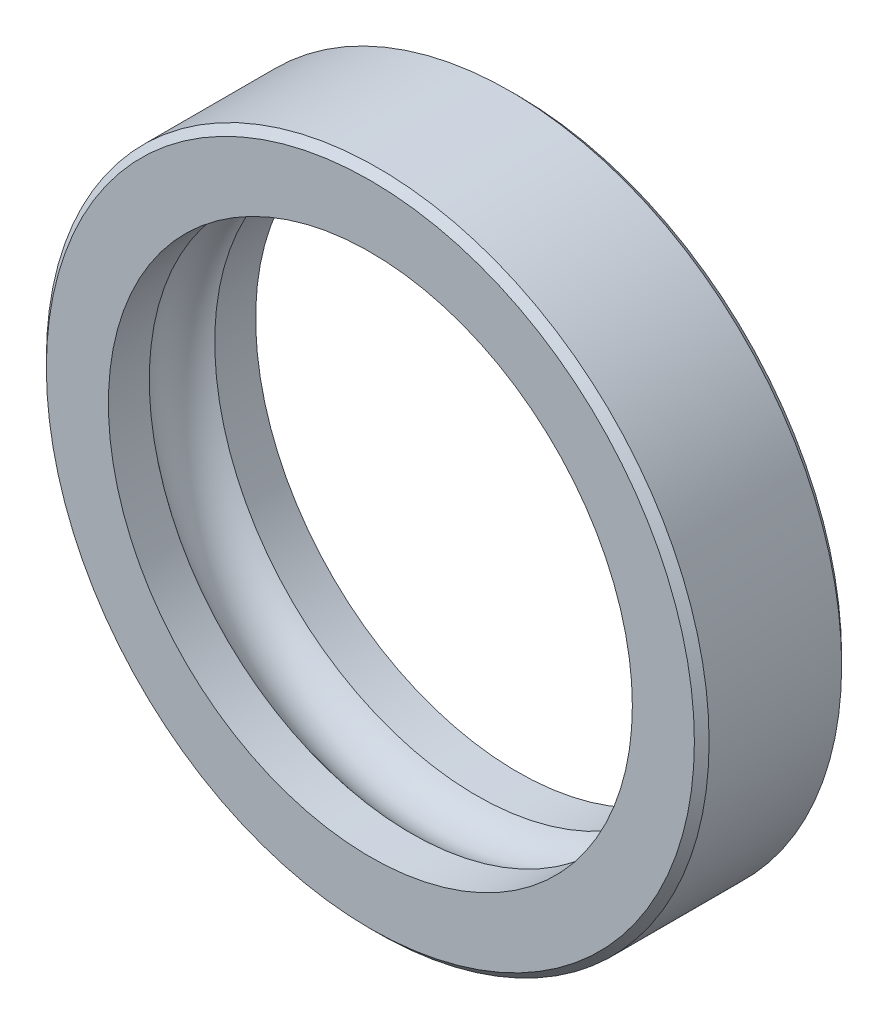
ISO-10303-21;
HEADER;
FILE_DESCRIPTION(('STEP AP214'),'2;1');
FILE_NAME('part.step','',(''),(''),'','','');
FILE_SCHEMA(('AUTOMOTIVE_DESIGN { 1 0 10303 214 1 1 1 1 }'));
ENDSEC;
DATA;
#1=APPLICATION_CONTEXT('core data for automotive mechanical design processes');
#2=APPLICATION_PROTOCOL_DEFINITION('international standard','automotive_design',2000,#1);
#3=PRODUCT_CONTEXT('',#1,'mechanical');
#4=PRODUCT('Part','Part','',(#3));
#5=PRODUCT_RELATED_PRODUCT_CATEGORY('part','',(#4));
#6=PRODUCT_DEFINITION_FORMATION('','',#4);
#7=PRODUCT_DEFINITION_CONTEXT('part definition',#1,'design');
#8=PRODUCT_DEFINITION('design','',#6,#7);
#9=PRODUCT_DEFINITION_SHAPE('','',#8);
#10=(LENGTH_UNIT() NAMED_UNIT(*) SI_UNIT(.MILLI.,.METRE.));
#11=(NAMED_UNIT(*) PLANE_ANGLE_UNIT() SI_UNIT($,.RADIAN.));
#12=(NAMED_UNIT(*) SI_UNIT($,.STERADIAN.) SOLID_ANGLE_UNIT());
#13=UNCERTAINTY_MEASURE_WITH_UNIT(LENGTH_MEASURE(1.E-05),#10,'distance_accuracy_value','');
#14=(GEOMETRIC_REPRESENTATION_CONTEXT(3) GLOBAL_UNCERTAINTY_ASSIGNED_CONTEXT((#13)) GLOBAL_UNIT_ASSIGNED_CONTEXT((#10,
#11,#12)) REPRESENTATION_CONTEXT('',''));
#15=CARTESIAN_POINT('',(0.,0.,0.));
#16=DIRECTION('',(0.,0.,1.));
#17=DIRECTION('',(1.,0.,0.));
#18=AXIS2_PLACEMENT_3D('',#15,#16,#17);
#19=CARTESIAN_POINT('',(0.,0.,0.));
#20=DIRECTION('',(0.,0.,1.));
#21=DIRECTION('',(1.,0.,0.));
#22=AXIS2_PLACEMENT_3D('',#19,#20,#21);
#23=TOROIDAL_SURFACE('',#22,10.31875,1.71627890103155);
#24=CARTESIAN_POINT('',(0.,0.,-1.41111111111112));
#25=DIRECTION('',(0.,0.,1.));
#26=DIRECTION('',(1.,0.,0.));
#27=AXIS2_PLACEMENT_3D('',#24,#25,#26);
#28=CIRCLE('',#27,11.2956730769231);
#29=CARTESIAN_POINT('',(11.2956730769231,0.,-1.41111111111112));
#30=VERTEX_POINT('',#29);
#31=EDGE_CURVE('E38',#30,#30,#28,.F.);
#32=ORIENTED_EDGE('',*,*,#31,.T.);
#33=EDGE_LOOP('',(#32));
#34=FACE_BOUND('',#33,.T.);
#35=CARTESIAN_POINT('',(0.,0.,1.4111111111111));
#36=DIRECTION('',(0.,0.,1.));
#37=DIRECTION('',(1.,0.,0.));
#38=AXIS2_PLACEMENT_3D('',#35,#36,#37);
#39=CIRCLE('',#38,11.2956730769231);
#40=CARTESIAN_POINT('',(11.2956730769231,0.,1.4111111111111));
#41=VERTEX_POINT('',#40);
#42=EDGE_CURVE('E35',#41,#41,#39,.T.);
#43=ORIENTED_EDGE('',*,*,#42,.T.);
#44=EDGE_LOOP('',(#43));
#45=FACE_BOUND('',#44,.T.);
#46=ADVANCED_FACE('F15',(#34,#45),#23,.F.);
#47=CARTESIAN_POINT('',(0.,0.,3.175));
#48=DIRECTION('',(0.,0.,1.));
#49=DIRECTION('',(1.,0.,0.));
#50=AXIS2_PLACEMENT_3D('',#47,#48,#49);
#51=CYLINDRICAL_SURFACE('',#50,11.2956730769231);
#52=CARTESIAN_POINT('',(0.,0.,-3.175));
#53=DIRECTION('',(0.,0.,1.));
#54=DIRECTION('',(1.,0.,0.));
#55=AXIS2_PLACEMENT_3D('',#52,#53,#54);
#56=CIRCLE('',#55,11.2956730769231);
#57=CARTESIAN_POINT('',(11.2956730769231,0.,-3.175));
#58=VERTEX_POINT('',#57);
#59=EDGE_CURVE('E19',#58,#58,#56,.F.);
#60=ORIENTED_EDGE('',*,*,#59,.T.);
#61=EDGE_LOOP('',(#60));
#62=FACE_BOUND('',#61,.T.);
#63=ORIENTED_EDGE('',*,*,#31,.F.);
#64=EDGE_LOOP('',(#63));
#65=FACE_BOUND('',#64,.T.);
#66=ADVANCED_FACE('F57',(#62,#65),#51,.F.);
#67=CARTESIAN_POINT('',(0.,0.,3.175));
#68=DIRECTION('',(0.,0.,1.));
#69=DIRECTION('',(1.,0.,0.));
#70=AXIS2_PLACEMENT_3D('',#67,#68,#69);
#71=CYLINDRICAL_SURFACE('',#70,11.2956730769231);
#72=ORIENTED_EDGE('',*,*,#42,.F.);
#73=EDGE_LOOP('',(#72));
#74=FACE_BOUND('',#73,.T.);
#75=CARTESIAN_POINT('',(0.,0.,3.175));
#76=DIRECTION('',(0.,0.,1.));
#77=DIRECTION('',(1.,0.,0.));
#78=AXIS2_PLACEMENT_3D('',#75,#76,#77);
#79=CIRCLE('',#78,11.2956730769231);
#80=CARTESIAN_POINT('',(11.2956730769231,0.,3.175));
#81=VERTEX_POINT('',#80);
#82=EDGE_CURVE('E50',#81,#81,#79,.T.);
#83=ORIENTED_EDGE('',*,*,#82,.T.);
#84=EDGE_LOOP('',(#83));
#85=FACE_BOUND('',#84,.T.);
#86=ADVANCED_FACE('F64',(#74,#85),#71,.F.);
#87=CARTESIAN_POINT('',(0.,13.97,-3.175));
#88=DIRECTION('',(0.,0.,1.));
#89=DIRECTION('',(1.,0.,0.));
#90=AXIS2_PLACEMENT_3D('',#87,#88,#89);
#91=PLANE('',#90);
#92=ORIENTED_EDGE('',*,*,#59,.F.);
#93=EDGE_LOOP('',(#92));
#94=FACE_BOUND('',#93,.T.);
#95=CARTESIAN_POINT('',(0.,0.,-3.17500001025784));
#96=DIRECTION('',(0.,0.,1.));
#97=DIRECTION('',(1.,0.,0.));
#98=AXIS2_PLACEMENT_3D('',#95,#96,#97);
#99=CIRCLE('',#98,13.9700000102578);
#100=CARTESIAN_POINT('',(13.9700000102578,0.,-3.17500001025784));
#101=VERTEX_POINT('',#100);
#102=EDGE_CURVE('E48',#101,#101,#99,.T.);
#103=ORIENTED_EDGE('',*,*,#102,.F.);
#104=EDGE_LOOP('',(#103));
#105=FACE_BOUND('',#104,.T.);
#106=ADVANCED_FACE('F60',(#94,#105),#91,.F.);
#107=CARTESIAN_POINT('',(0.,13.97,3.175));
#108=DIRECTION('',(0.,0.,-1.));
#109=DIRECTION('',(-1.,0.,0.));
#110=AXIS2_PLACEMENT_3D('',#107,#108,#109);
#111=PLANE('',#110);
#112=ORIENTED_EDGE('',*,*,#82,.F.);
#113=EDGE_LOOP('',(#112));
#114=FACE_BOUND('',#113,.T.);
#115=CARTESIAN_POINT('',(0.,0.,3.17500001025783));
#116=DIRECTION('',(0.,0.,-1.));
#117=DIRECTION('',(-1.,0.,0.));
#118=AXIS2_PLACEMENT_3D('',#115,#116,#117);
#119=CIRCLE('',#118,13.9700000102578);
#120=CARTESIAN_POINT('',(-13.9700000102578,0.,3.17500001025783));
#121=VERTEX_POINT('',#120);
#122=EDGE_CURVE('E28',#121,#121,#119,.T.);
#123=ORIENTED_EDGE('',*,*,#122,.F.);
#124=EDGE_LOOP('',(#123));
#125=FACE_BOUND('',#124,.T.);
#126=ADVANCED_FACE('F63',(#114,#125),#111,.F.);
#127=CARTESIAN_POINT('',(0.,0.,-2.8575000099729));
#128=DIRECTION('',(0.,0.,1.));
#129=DIRECTION('',(1.,0.,0.));
#130=AXIS2_PLACEMENT_3D('',#127,#128,#129);
#131=CONICAL_SURFACE('',#130,14.2875000099729,0.785398162499998);
#132=CARTESIAN_POINT('',(0.,0.,-2.8575));
#133=DIRECTION('',(0.,0.,1.));
#134=DIRECTION('',(1.,0.,0.));
#135=AXIS2_PLACEMENT_3D('',#132,#133,#134);
#136=CIRCLE('',#135,14.2875);
#137=CARTESIAN_POINT('',(14.2875,0.,-2.8575));
#138=VERTEX_POINT('',#137);
#139=EDGE_CURVE('E23',#138,#138,#136,.T.);
#140=ORIENTED_EDGE('',*,*,#139,.F.);
#141=EDGE_LOOP('',(#140));
#142=FACE_BOUND('',#141,.T.);
#143=ORIENTED_EDGE('',*,*,#102,.T.);
#144=EDGE_LOOP('',(#143));
#145=FACE_BOUND('',#144,.T.);
#146=ADVANCED_FACE('F68',(#142,#145),#131,.T.);
#147=CARTESIAN_POINT('',(0.,0.,2.85750000997289));
#148=DIRECTION('',(0.,0.,-1.));
#149=DIRECTION('',(-1.,0.,0.));
#150=AXIS2_PLACEMENT_3D('',#147,#148,#149);
#151=CONICAL_SURFACE('',#150,14.2875000099729,0.785398162499998);
#152=CARTESIAN_POINT('',(0.,0.,2.8575));
#153=DIRECTION('',(0.,0.,1.));
#154=DIRECTION('',(1.,0.,0.));
#155=AXIS2_PLACEMENT_3D('',#152,#153,#154);
#156=CIRCLE('',#155,14.2875);
#157=CARTESIAN_POINT('',(14.2875,0.,2.8575));
#158=VERTEX_POINT('',#157);
#159=EDGE_CURVE('E10',#158,#158,#156,.F.);
#160=ORIENTED_EDGE('',*,*,#159,.F.);
#161=EDGE_LOOP('',(#160));
#162=FACE_BOUND('',#161,.T.);
#163=ORIENTED_EDGE('',*,*,#122,.T.);
#164=EDGE_LOOP('',(#163));
#165=FACE_BOUND('',#164,.T.);
#166=ADVANCED_FACE('F70',(#162,#165),#151,.T.);
#167=CARTESIAN_POINT('',(0.,0.,3.175));
#168=DIRECTION('',(0.,0.,1.));
#169=DIRECTION('',(1.,0.,0.));
#170=AXIS2_PLACEMENT_3D('',#167,#168,#169);
#171=CYLINDRICAL_SURFACE('',#170,14.2875);
#172=ORIENTED_EDGE('',*,*,#159,.T.);
#173=EDGE_LOOP('',(#172));
#174=FACE_BOUND('',#173,.T.);
#175=ORIENTED_EDGE('',*,*,#139,.T.);
#176=EDGE_LOOP('',(#175));
#177=FACE_BOUND('',#176,.T.);
#178=ADVANCED_FACE('F78',(#174,#177),#171,.T.);
#179=CLOSED_SHELL('',(#46,#66,#86,#106,#126,#146,#166,#178));
#180=MANIFOLD_SOLID_BREP('B1',#179);
#181=ADVANCED_BREP_SHAPE_REPRESENTATION('',(#18,#180),#14);
#182=SHAPE_DEFINITION_REPRESENTATION(#9,#181);
ENDSEC;
END-ISO-10303-21;
